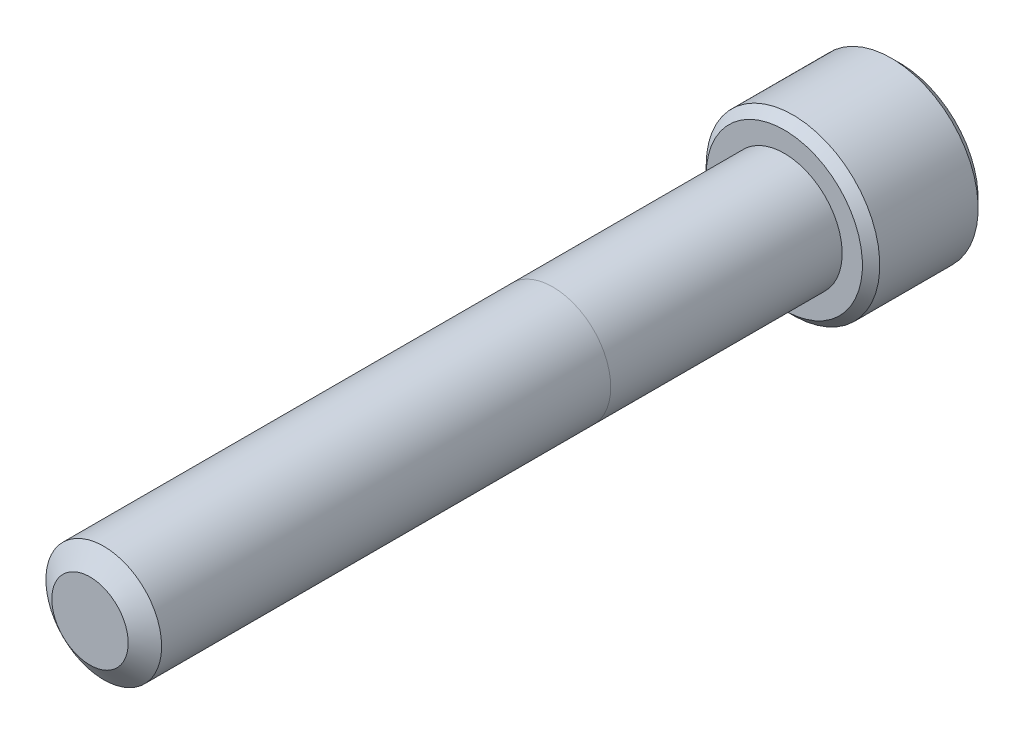
ISO-10303-21;
HEADER;
FILE_DESCRIPTION(('STEP AP214'),'2;1');
FILE_NAME('part.step','',(''),(''),'','','');
FILE_SCHEMA(('AUTOMOTIVE_DESIGN { 1 0 10303 214 1 1 1 1 }'));
ENDSEC;
DATA;
#1=APPLICATION_CONTEXT('core data for automotive mechanical design processes');
#2=APPLICATION_PROTOCOL_DEFINITION('international standard','automotive_design',2000,#1);
#3=PRODUCT_CONTEXT('',#1,'mechanical');
#4=PRODUCT('Part','Part','',(#3));
#5=PRODUCT_RELATED_PRODUCT_CATEGORY('part','',(#4));
#6=PRODUCT_DEFINITION_FORMATION('','',#4);
#7=PRODUCT_DEFINITION_CONTEXT('part definition',#1,'design');
#8=PRODUCT_DEFINITION('design','',#6,#7);
#9=PRODUCT_DEFINITION_SHAPE('','',#8);
#10=(LENGTH_UNIT() NAMED_UNIT(*) SI_UNIT(.MILLI.,.METRE.));
#11=(NAMED_UNIT(*) PLANE_ANGLE_UNIT() SI_UNIT($,.RADIAN.));
#12=(NAMED_UNIT(*) SI_UNIT($,.STERADIAN.) SOLID_ANGLE_UNIT());
#13=UNCERTAINTY_MEASURE_WITH_UNIT(LENGTH_MEASURE(1.E-05),#10,'distance_accuracy_value','');
#14=(GEOMETRIC_REPRESENTATION_CONTEXT(3) GLOBAL_UNCERTAINTY_ASSIGNED_CONTEXT((#13)) GLOBAL_UNIT_ASSIGNED_CONTEXT((#10,
#11,#12)) REPRESENTATION_CONTEXT('',''));
#15=CARTESIAN_POINT('',(0.,0.,0.));
#16=DIRECTION('',(0.,0.,1.));
#17=DIRECTION('',(1.,0.,0.));
#18=AXIS2_PLACEMENT_3D('',#15,#16,#17);
#19=CARTESIAN_POINT('',(0.,0.,-38.1));
#20=DIRECTION('',(0.,0.,1.));
#21=DIRECTION('',(1.,0.,0.));
#22=AXIS2_PLACEMENT_3D('',#19,#20,#21);
#23=CYLINDRICAL_SURFACE('',#22,3.175);
#24=CARTESIAN_POINT('',(0.,0.,-0.755446348705716));
#25=DIRECTION('',(0.,0.,1.));
#26=DIRECTION('',(1.,0.,0.));
#27=AXIS2_PLACEMENT_3D('',#24,#25,#26);
#28=CIRCLE('',#27,3.175);
#29=CARTESIAN_POINT('',(3.175,0.,-0.755446348705716));
#30=VERTEX_POINT('',#29);
#31=EDGE_CURVE('E113',#30,#30,#28,.T.);
#32=ORIENTED_EDGE('',*,*,#31,.F.);
#33=EDGE_LOOP('',(#32));
#34=FACE_BOUND('',#33,.T.);
#35=CARTESIAN_POINT('',(0.,0.,-25.4));
#36=DIRECTION('',(0.,0.,-1.));
#37=DIRECTION('',(-1.,0.,0.));
#38=AXIS2_PLACEMENT_3D('',#35,#36,#37);
#39=CIRCLE('',#38,3.175);
#40=CARTESIAN_POINT('',(3.175,0.,-25.4));
#41=VERTEX_POINT('',#40);
#42=CARTESIAN_POINT('',(-3.175,0.,-25.4));
#43=VERTEX_POINT('',#42);
#44=EDGE_CURVE('E40',#41,#43,#39,.F.);
#45=ORIENTED_EDGE('',*,*,#44,.T.);
#46=EDGE_CURVE('E11',#43,#41,#39,.F.);
#47=ORIENTED_EDGE('',*,*,#46,.T.);
#48=EDGE_LOOP('',(#45,#47));
#49=FACE_BOUND('',#48,.T.);
#50=ADVANCED_FACE('F36',(#34,#49),#23,.T.);
#51=ORIENTED_EDGE('',*,*,#46,.F.);
#52=ORIENTED_EDGE('',*,*,#44,.F.);
#53=EDGE_LOOP('',(#51,#52));
#54=FACE_BOUND('',#53,.T.);
#55=CARTESIAN_POINT('',(0.,0.,-38.1));
#56=DIRECTION('',(0.,0.,-1.));
#57=DIRECTION('',(-1.,0.,0.));
#58=AXIS2_PLACEMENT_3D('',#55,#56,#57);
#59=CIRCLE('',#58,3.175);
#60=CARTESIAN_POINT('',(-3.175,0.,-38.1));
#61=VERTEX_POINT('',#60);
#62=EDGE_CURVE('E197',#61,#61,#59,.F.);
#63=ORIENTED_EDGE('',*,*,#62,.T.);
#64=EDGE_LOOP('',(#63));
#65=FACE_BOUND('',#64,.T.);
#66=ADVANCED_FACE('F190',(#54,#65),#23,.T.);
#67=CARTESIAN_POINT('',(0.,0.,0.));
#68=DIRECTION('',(0.,0.,-1.));
#69=DIRECTION('',(-1.,0.,0.));
#70=AXIS2_PLACEMENT_3D('',#67,#68,#69);
#71=CONICAL_SURFACE('',#70,2.09611080289532,0.959931088596884);
#72=ORIENTED_EDGE('',*,*,#31,.T.);
#73=EDGE_LOOP('',(#72));
#74=FACE_BOUND('',#73,.T.);
#75=CARTESIAN_POINT('',(0.,0.,0.));
#76=DIRECTION('',(0.,0.,1.));
#77=DIRECTION('',(1.,0.,0.));
#78=AXIS2_PLACEMENT_3D('',#75,#76,#77);
#79=CIRCLE('',#78,2.09611080289532);
#80=CARTESIAN_POINT('',(2.09611080289532,0.,0.));
#81=VERTEX_POINT('',#80);
#82=EDGE_CURVE('E199',#81,#81,#79,.T.);
#83=ORIENTED_EDGE('',*,*,#82,.F.);
#84=EDGE_LOOP('',(#83));
#85=FACE_BOUND('',#84,.T.);
#86=ADVANCED_FACE('F193',(#74,#85),#71,.T.);
#87=CARTESIAN_POINT('',(0.,0.,0.));
#88=DIRECTION('',(0.,0.,1.));
#89=DIRECTION('',(1.,0.,0.));
#90=AXIS2_PLACEMENT_3D('',#87,#88,#89);
#91=PLANE('',#90);
#92=ORIENTED_EDGE('',*,*,#82,.T.);
#93=EDGE_LOOP('',(#92));
#94=FACE_BOUND('',#93,.T.);
#95=ADVANCED_FACE('F258',(#94),#91,.T.);
#96=CARTESIAN_POINT('',(0.,0.,-44.45));
#97=DIRECTION('',(0.,0.,1.));
#98=DIRECTION('',(1.,0.,0.));
#99=AXIS2_PLACEMENT_3D('',#96,#97,#98);
#100=CYLINDRICAL_SURFACE('',#99,4.7625);
#101=CARTESIAN_POINT('',(0.,0.,-43.97375));
#102=DIRECTION('',(0.,0.,-1.));
#103=DIRECTION('',(-1.,0.,0.));
#104=AXIS2_PLACEMENT_3D('',#101,#102,#103);
#105=CIRCLE('',#104,4.7625);
#106=CARTESIAN_POINT('',(-4.7625,0.,-43.97375));
#107=VERTEX_POINT('',#106);
#108=EDGE_CURVE('E181',#107,#107,#105,.F.);
#109=ORIENTED_EDGE('',*,*,#108,.T.);
#110=EDGE_LOOP('',(#109));
#111=FACE_BOUND('',#110,.T.);
#112=CARTESIAN_POINT('',(0.,0.,-38.57625));
#113=DIRECTION('',(0.,0.,-1.));
#114=DIRECTION('',(-1.,0.,0.));
#115=AXIS2_PLACEMENT_3D('',#112,#113,#114);
#116=CIRCLE('',#115,4.7625);
#117=CARTESIAN_POINT('',(-4.7625,0.,-38.57625));
#118=VERTEX_POINT('',#117);
#119=EDGE_CURVE('E178',#118,#118,#116,.T.);
#120=ORIENTED_EDGE('',*,*,#119,.T.);
#121=EDGE_LOOP('',(#120));
#122=FACE_BOUND('',#121,.T.);
#123=ADVANCED_FACE('F274',(#111,#122),#100,.T.);
#124=CARTESIAN_POINT('',(0.,0.,-44.45));
#125=DIRECTION('',(0.,0.,-1.));
#126=DIRECTION('',(-1.,0.,0.));
#127=AXIS2_PLACEMENT_3D('',#124,#125,#126);
#128=PLANE('',#127);
#129=CARTESIAN_POINT('',(0.,0.,-44.45));
#130=DIRECTION('',(0.,0.,-1.));
#131=DIRECTION('',(-1.,0.,0.));
#132=AXIS2_PLACEMENT_3D('',#129,#130,#131);
#133=CIRCLE('',#132,4.28625000000001);
#134=CARTESIAN_POINT('',(-4.28625000000001,0.,-44.45));
#135=VERTEX_POINT('',#134);
#136=EDGE_CURVE('E112',#135,#135,#133,.T.);
#137=ORIENTED_EDGE('',*,*,#136,.T.);
#138=EDGE_LOOP('',(#137));
#139=FACE_BOUND('',#138,.T.);
#140=CARTESIAN_POINT('',(0.,0.,-44.45));
#141=DIRECTION('',(0.,0.,-1.));
#142=DIRECTION('',(-1.,0.,0.));
#143=AXIS2_PLACEMENT_3D('',#140,#141,#142);
#144=CIRCLE('',#143,2.74963065701559);
#145=CARTESIAN_POINT('',(-2.38125,1.3748153285078,-44.45));
#146=VERTEX_POINT('',#145);
#147=CARTESIAN_POINT('',(0.,2.74963065701559,-44.45));
#148=VERTEX_POINT('',#147);
#149=EDGE_CURVE('E91',#146,#148,#144,.T.);
#150=ORIENTED_EDGE('',*,*,#149,.F.);
#151=CARTESIAN_POINT('',(-2.38125,-1.3748153285078,-44.45));
#152=VERTEX_POINT('',#151);
#153=EDGE_CURVE('E103',#152,#146,#144,.T.);
#154=ORIENTED_EDGE('',*,*,#153,.F.);
#155=CARTESIAN_POINT('',(0.,-2.74963065701559,-44.45));
#156=VERTEX_POINT('',#155);
#157=EDGE_CURVE('E437',#156,#152,#144,.T.);
#158=ORIENTED_EDGE('',*,*,#157,.F.);
#159=CARTESIAN_POINT('',(2.38125,-1.3748153285078,-44.45));
#160=VERTEX_POINT('',#159);
#161=EDGE_CURVE('E136',#160,#156,#144,.T.);
#162=ORIENTED_EDGE('',*,*,#161,.F.);
#163=CARTESIAN_POINT('',(2.38125,1.3748153285078,-44.45));
#164=VERTEX_POINT('',#163);
#165=EDGE_CURVE('E135',#164,#160,#144,.T.);
#166=ORIENTED_EDGE('',*,*,#165,.F.);
#167=EDGE_CURVE('E101',#148,#164,#144,.T.);
#168=ORIENTED_EDGE('',*,*,#167,.F.);
#169=EDGE_LOOP('',(#150,#154,#158,#162,#166,#168));
#170=FACE_BOUND('',#169,.T.);
#171=ADVANCED_FACE('F133',(#139,#170),#128,.T.);
#172=CARTESIAN_POINT('',(0.,0.,-38.1));
#173=DIRECTION('',(0.,0.,-1.));
#174=DIRECTION('',(-1.,0.,0.));
#175=AXIS2_PLACEMENT_3D('',#172,#173,#174);
#176=PLANE('',#175);
#177=CARTESIAN_POINT('',(0.,0.,-38.1));
#178=DIRECTION('',(0.,0.,-1.));
#179=DIRECTION('',(-1.,0.,0.));
#180=AXIS2_PLACEMENT_3D('',#177,#178,#179);
#181=CIRCLE('',#180,4.28624999999999);
#182=CARTESIAN_POINT('',(-4.28624999999999,0.,-38.1));
#183=VERTEX_POINT('',#182);
#184=EDGE_CURVE('E183',#183,#183,#181,.F.);
#185=ORIENTED_EDGE('',*,*,#184,.T.);
#186=EDGE_LOOP('',(#185));
#187=FACE_BOUND('',#186,.T.);
#188=ORIENTED_EDGE('',*,*,#62,.F.);
#189=EDGE_LOOP('',(#188));
#190=FACE_BOUND('',#189,.T.);
#191=ADVANCED_FACE('F273',(#187,#190),#176,.F.);
#192=CARTESIAN_POINT('',(0.,0.,-44.45));
#193=DIRECTION('',(0.,0.,-1.));
#194=DIRECTION('',(-1.,0.,0.));
#195=AXIS2_PLACEMENT_3D('',#192,#193,#194);
#196=CONICAL_SURFACE('',#195,2.74963065701559,0.78539816339745);
#197=ORIENTED_EDGE('',*,*,#167,.T.);
#198=CARTESIAN_POINT('',(-0.000199999999999015,2.74974612706943,-44.4501154773272));
#199=CARTESIAN_POINT('',(0.0816567823790507,2.70248609172789,-44.4028948967095));
#200=CARTESIAN_POINT('',(0.164882333771761,2.65443579722785,-44.3584475752929));
#201=CARTESIAN_POINT('',(0.334588480838041,2.556455907536,-44.2770654569856));
#202=CARTESIAN_POINT('',(0.421085217353104,2.50651699342501,-44.2401759430951));
#203=CARTESIAN_POINT('',(0.595501774009044,2.40581754748857,-44.1769834131659));
#204=CARTESIAN_POINT('',(0.683377171180677,2.35508266327638,-44.1505215587295));
#205=CARTESIAN_POINT('',(0.861062594070877,2.25249593653965,-44.1097515156161));
#206=CARTESIAN_POINT('',(0.950867191185873,2.20064722822085,-44.0954128915306));
#207=CARTESIAN_POINT('',(1.10563960313034,2.11128933452158,-44.0824757847701));
#208=CARTESIAN_POINT('',(1.17040744896962,2.07389560129144,-44.0805606046532));
#209=CARTESIAN_POINT('',(1.29983727933558,1.99916925388849,-44.0837866227677));
#210=CARTESIAN_POINT('',(1.36449921879336,1.96183666573621,-44.0889302948571));
#211=CARTESIAN_POINT('',(1.4932125485774,1.8875239901371,-44.1059813108716));
#212=CARTESIAN_POINT('',(1.55726317423486,1.85054434417201,-44.1178962213493));
#213=CARTESIAN_POINT('',(1.68425683890528,1.77722451768916,-44.147835672352));
#214=CARTESIAN_POINT('',(1.74719996243583,1.74088428837516,-44.1658597445185));
#215=CARTESIAN_POINT('',(1.90842615073218,1.64780030516185,-44.2193688075524));
#216=CARTESIAN_POINT('',(2.00570949128784,1.59163374230437,-44.2588874208722));
#217=CARTESIAN_POINT('',(2.14875606262557,1.50904576583588,-44.3256003435508));
#218=CARTESIAN_POINT('',(2.19589628894397,1.48182934348129,-44.3490402091113));
#219=CARTESIAN_POINT('',(2.28930352636664,1.42790064981105,-44.3980566766595));
#220=CARTESIAN_POINT('',(2.33557105249682,1.40118808114506,-44.4236319667669));
#221=CARTESIAN_POINT('',(2.38145,1.37469985845396,-44.4501154773272));
#222=B_SPLINE_CURVE_WITH_KNOTS('',3,(#198,#199,#200,#201,#202,#203,#204,#205,#206,#207,#208,
#209,#210,#211,#212,#213,#214,#215,#216,#217,#218,#219,#220,#221),.UNSPECIFIED.,.F.,.F.,(4,2,2,
2,2,2,2,2,2,2,2,4),(0.,0.317196610611949,0.636241461041219,0.950218950629223,1.26340583824126,
1.48752413747844,1.71172100167747,1.93616888974082,2.16059957440836,2.51709639744762,
2.69486147369099,2.87251813383153),.UNSPECIFIED.);
#223=EDGE_CURVE('E107',#148,#164,#222,.T.);
#224=ORIENTED_EDGE('',*,*,#223,.F.);
#225=EDGE_LOOP('',(#197,#224));
#226=FACE_BOUND('',#225,.T.);
#227=ADVANCED_FACE('F108',(#226),#196,.F.);
#228=ORIENTED_EDGE('',*,*,#165,.T.);
#229=CARTESIAN_POINT('',(2.38125,-2.7419429062928,-45.3319808948811));
#230=CARTESIAN_POINT('',(2.38125,-2.67517961094814,-45.2815846682677));
#231=CARTESIAN_POINT('',(2.38125,-2.60804251150403,-45.2316755878687));
#232=CARTESIAN_POINT('',(2.38125,-2.47287325090701,-45.1330498312406));
#233=CARTESIAN_POINT('',(2.38125,-2.40484086929573,-45.0843334574882));
#234=CARTESIAN_POINT('',(2.38125,-2.26723593537395,-44.9879648546737));
#235=CARTESIAN_POINT('',(2.38125,-2.1976555337683,-44.9403237956413));
#236=CARTESIAN_POINT('',(2.38125,-2.05731367870618,-44.8468199235723));
#237=CARTESIAN_POINT('',(2.38125,-1.98655230919794,-44.800956984903));
#238=CARTESIAN_POINT('',(2.38125,-1.83957751933871,-44.7088459008639));
#239=CARTESIAN_POINT('',(2.38125,-1.76328362015337,-44.6627255175311));
#240=CARTESIAN_POINT('',(2.38125,-1.60891357724904,-44.5735183040048));
#241=CARTESIAN_POINT('',(2.38125,-1.53083712168147,-44.530432010078));
#242=CARTESIAN_POINT('',(2.38125,-1.37291620350605,-44.4482265015513));
#243=CARTESIAN_POINT('',(2.38125,-1.29307799952833,-44.4090953579213));
#244=CARTESIAN_POINT('',(2.38125,-1.13121425104688,-44.3356679503644));
#245=CARTESIAN_POINT('',(2.38125,-1.04918943691787,-44.3013700954936));
#246=CARTESIAN_POINT('',(2.38125,-0.889535256852423,-44.2413546314485));
#247=CARTESIAN_POINT('',(2.38125,-0.812083865872983,-44.2151684784655));
#248=CARTESIAN_POINT('',(2.38125,-0.655316366649842,-44.1690097515196));
#249=CARTESIAN_POINT('',(2.38125,-0.576000130348893,-44.1490376056152));
#250=CARTESIAN_POINT('',(2.38125,-0.417295761724879,-44.1166821452753));
#251=CARTESIAN_POINT('',(2.38125,-0.337934577044905,-44.1041688083777));
#252=CARTESIAN_POINT('',(2.38125,-0.178363853149427,-44.0869738601797));
#253=CARTESIAN_POINT('',(2.38125,-0.098154462150844,-44.0822909026207));
#254=CARTESIAN_POINT('',(2.38125,0.0594188032260163,-44.0811044408343));
#255=CARTESIAN_POINT('',(2.38125,0.136780588312053,-44.0843110104925));
#256=CARTESIAN_POINT('',(2.38125,0.290840960378529,-44.0980870567153));
#257=CARTESIAN_POINT('',(2.38125,0.367539482199556,-44.1086572485512));
#258=CARTESIAN_POINT('',(2.38125,0.521017492585631,-44.1367628297993));
#259=CARTESIAN_POINT('',(2.38125,0.597774958137452,-44.1544167488691));
#260=CARTESIAN_POINT('',(2.38125,0.749609813987393,-44.1957513961625));
#261=CARTESIAN_POINT('',(2.38125,0.82468734429223,-44.2194316201001));
#262=CARTESIAN_POINT('',(2.38125,1.0610781437644,-44.3028948628217));
#263=CARTESIAN_POINT('',(2.38125,1.21904786183135,-44.3721839268647));
#264=CARTESIAN_POINT('',(2.38125,1.45021000221342,-44.4876640836208));
#265=CARTESIAN_POINT('',(2.38125,1.52644290394186,-44.5281730569973));
#266=CARTESIAN_POINT('',(2.38125,1.67717618485052,-44.6123026889314));
#267=CARTESIAN_POINT('',(2.38125,1.75167687303398,-44.6559227867715));
#268=CARTESIAN_POINT('',(2.38125,1.89548152028666,-44.7434125561176));
#269=CARTESIAN_POINT('',(2.38125,1.96485959547431,-44.78716179235));
#270=CARTESIAN_POINT('',(2.38125,2.10242624345817,-44.8765011582982));
#271=CARTESIAN_POINT('',(2.38125,2.17061472559402,-44.9220914274512));
#272=CARTESIAN_POINT('',(2.38125,2.30540317246411,-45.0144060045998));
#273=CARTESIAN_POINT('',(2.38125,2.3720115414939,-45.0611180923826));
#274=CARTESIAN_POINT('',(2.38125,2.50431799978027,-45.1557775774644));
#275=CARTESIAN_POINT('',(2.38125,2.57001633432538,-45.2037246315223));
#276=CARTESIAN_POINT('',(2.38125,2.63533378775874,-45.2521767329484));
#277=B_SPLINE_CURVE_WITH_KNOTS('',3,(#229,#230,#231,#232,#233,#234,#235,#236,#237,#238,#239,
#240,#241,#242,#243,#244,#245,#246,#247,#248,#249,#250,#251,#252,#253,#254,#255,#256,#257,#258,
#259,#260,#261,#262,#263,#264,#265,#266,#267,#268,#269,#270,#271,#272,#273,#274,#275,#276),
.UNSPECIFIED.,.F.,.F.,(4,2,2,2,2,2,2,2,2,2,2,2,2,2,2,2,2,2,2,2,2,2,2,4),(0.,0.250951284057754,
0.501965564923431,0.754924776117812,1.00786608183831,1.27526207823639,1.54270521810291,
1.80931602064962,2.07583885853549,2.32089852628726,2.56597507150035,2.80664400340548,
3.04727155341464,3.27918940999225,3.51112979724108,3.74712477430216,3.98310000960232,
4.49898139186046,4.75794323923241,5.01685853131884,5.26288959989712,5.50893933760936,
5.75299038355429,5.99697431578282),.UNSPECIFIED.);
#278=EDGE_CURVE('E100',#164,#160,#277,.F.);
#279=ORIENTED_EDGE('',*,*,#278,.F.);
#280=EDGE_LOOP('',(#228,#279));
#281=FACE_BOUND('',#280,.T.);
#282=ADVANCED_FACE('F374',(#281),#196,.F.);
#283=ORIENTED_EDGE('',*,*,#161,.T.);
#284=CARTESIAN_POINT('',(2.38145,-1.37469985845396,-44.4501154773272));
#285=CARTESIAN_POINT('',(2.29959321762095,-1.4219598937955,-44.4028948967095));
#286=CARTESIAN_POINT('',(2.21636766622824,-1.47001018829554,-44.3584475752929));
#287=CARTESIAN_POINT('',(2.04666151916196,-1.56799007798739,-44.2770654569856));
#288=CARTESIAN_POINT('',(1.96016478264689,-1.61792899209838,-44.2401759430951));
#289=CARTESIAN_POINT('',(1.78574822599096,-1.71862843803482,-44.1769834131659));
#290=CARTESIAN_POINT('',(1.69787282881932,-1.76936332224701,-44.1505215587295));
#291=CARTESIAN_POINT('',(1.52018740592912,-1.87195004898374,-44.1097515156161));
#292=CARTESIAN_POINT('',(1.43038280881413,-1.92379875730254,-44.0954128915306));
#293=CARTESIAN_POINT('',(1.27561039686966,-2.01315665100181,-44.0824757847701));
#294=CARTESIAN_POINT('',(1.21084255103038,-2.05055038423195,-44.0805606046532));
#295=CARTESIAN_POINT('',(1.08141272066442,-2.1252767316349,-44.0837866227677));
#296=CARTESIAN_POINT('',(1.01675078120664,-2.16260931978718,-44.0889302948571));
#297=CARTESIAN_POINT('',(0.8880374514226,-2.23692199538629,-44.1059813108716));
#298=CARTESIAN_POINT('',(0.823986825765142,-2.27390164135138,-44.1178962213493));
#299=CARTESIAN_POINT('',(0.696993161094723,-2.34722146783423,-44.147835672352));
#300=CARTESIAN_POINT('',(0.634050037564173,-2.38356169714823,-44.1658597445185));
#301=CARTESIAN_POINT('',(0.472823849267816,-2.47664568036154,-44.2193688075524));
#302=CARTESIAN_POINT('',(0.375540508712157,-2.53281224321902,-44.2588874208722));
#303=CARTESIAN_POINT('',(0.232493937374428,-2.61540021968751,-44.3256003435508));
#304=CARTESIAN_POINT('',(0.185353711056034,-2.64261664204209,-44.3490402091113));
#305=CARTESIAN_POINT('',(0.0919464736333625,-2.69654533571233,-44.3980566766595));
#306=CARTESIAN_POINT('',(0.0456789475031799,-2.72325790437833,-44.4236319667669));
#307=CARTESIAN_POINT('',(-0.000199999999998765,-2.74974612706943,-44.4501154773272));
#308=B_SPLINE_CURVE_WITH_KNOTS('',3,(#284,#285,#286,#287,#288,#289,#290,#291,#292,#293,#294,
#295,#296,#297,#298,#299,#300,#301,#302,#303,#304,#305,#306,#307),.UNSPECIFIED.,.F.,.F.,(4,2,2,
2,2,2,2,2,2,2,2,4),(0.,0.317196610611951,0.63624146104122,0.950218950629225,1.26340583824126,
1.48752413747844,1.71172100167747,1.93616888974082,2.16059957440836,2.51709639744763,
2.69486147369099,2.87251813383154),.UNSPECIFIED.);
#309=EDGE_CURVE('E146',#160,#156,#308,.T.);
#310=ORIENTED_EDGE('',*,*,#309,.F.);
#311=EDGE_LOOP('',(#283,#310));
#312=FACE_BOUND('',#311,.T.);
#313=ADVANCED_FACE('F366',(#312),#196,.F.);
#314=ORIENTED_EDGE('',*,*,#157,.T.);
#315=CARTESIAN_POINT('',(0.000200000000000177,-2.74974612706943,-44.4501154773272));
#316=CARTESIAN_POINT('',(-0.0816567823790503,-2.70248609172789,-44.4028948967095));
#317=CARTESIAN_POINT('',(-0.164882333771761,-2.65443579722785,-44.3584475752929));
#318=CARTESIAN_POINT('',(-0.334588480838042,-2.556455907536,-44.2770654569856));
#319=CARTESIAN_POINT('',(-0.421085217353105,-2.50651699342501,-44.2401759430951));
#320=CARTESIAN_POINT('',(-0.595501774009045,-2.40581754748857,-44.1769834131659));
#321=CARTESIAN_POINT('',(-0.683377171180677,-2.35508266327638,-44.1505215587295));
#322=CARTESIAN_POINT('',(-0.861062594070878,-2.25249593653965,-44.1097515156161));
#323=CARTESIAN_POINT('',(-0.950867191185874,-2.20064722822084,-44.0954128915306));
#324=CARTESIAN_POINT('',(-1.10563960313034,-2.11128933452158,-44.0824757847701));
#325=CARTESIAN_POINT('',(-1.17040744896962,-2.07389560129144,-44.0805606046532));
#326=CARTESIAN_POINT('',(-1.29983727933558,-1.99916925388849,-44.0837866227677));
#327=CARTESIAN_POINT('',(-1.36449921879336,-1.96183666573621,-44.0889302948571));
#328=CARTESIAN_POINT('',(-1.4932125485774,-1.8875239901371,-44.1059813108716));
#329=CARTESIAN_POINT('',(-1.55726317423486,-1.85054434417201,-44.1178962213493));
#330=CARTESIAN_POINT('',(-1.68425683890528,-1.77722451768916,-44.147835672352));
#331=CARTESIAN_POINT('',(-1.74719996243583,-1.74088428837516,-44.1658597445185));
#332=CARTESIAN_POINT('',(-1.90842615073218,-1.64780030516184,-44.2193688075524));
#333=CARTESIAN_POINT('',(-2.00570949128784,-1.59163374230437,-44.2588874208722));
#334=CARTESIAN_POINT('',(-2.14875606262557,-1.50904576583588,-44.3256003435508));
#335=CARTESIAN_POINT('',(-2.19589628894397,-1.48182934348129,-44.3490402091113));
#336=CARTESIAN_POINT('',(-2.28930352636664,-1.42790064981105,-44.3980566766595));
#337=CARTESIAN_POINT('',(-2.33557105249682,-1.40118808114505,-44.4236319667669));
#338=CARTESIAN_POINT('',(-2.38145,-1.37469985845396,-44.4501154773272));
#339=B_SPLINE_CURVE_WITH_KNOTS('',3,(#315,#316,#317,#318,#319,#320,#321,#322,#323,#324,#325,
#326,#327,#328,#329,#330,#331,#332,#333,#334,#335,#336,#337,#338),.UNSPECIFIED.,.F.,.F.,(4,2,2,
2,2,2,2,2,2,2,2,4),(0.,0.317196610611951,0.63624146104122,0.950218950629225,1.26340583824126,
1.48752413747844,1.71172100167747,1.93616888974082,2.16059957440836,2.51709639744763,
2.69486147369099,2.87251813383154),.UNSPECIFIED.);
#340=EDGE_CURVE('E235',#156,#152,#339,.T.);
#341=ORIENTED_EDGE('',*,*,#340,.F.);
#342=EDGE_LOOP('',(#314,#341));
#343=FACE_BOUND('',#342,.T.);
#344=ADVANCED_FACE('F358',(#343),#196,.F.);
#345=ORIENTED_EDGE('',*,*,#153,.T.);
#346=CARTESIAN_POINT('',(-2.38125,-2.74194290589387,-45.3319808945799));
#347=CARTESIAN_POINT('',(-2.38125,-2.67517961056039,-45.2815846679781));
#348=CARTESIAN_POINT('',(-2.38125,-2.60804251112752,-45.2316755875907));
#349=CARTESIAN_POINT('',(-2.38125,-2.47287325055307,-45.1330498309857));
#350=CARTESIAN_POINT('',(-2.38125,-2.40484086895312,-45.0843334572448));
#351=CARTESIAN_POINT('',(-2.38125,-2.2672359350544,-44.9879648544534));
#352=CARTESIAN_POINT('',(-2.38125,-2.19765553346049,-44.9403237954326));
#353=CARTESIAN_POINT('',(-2.38125,-2.05731367842203,-44.8468199233866));
#354=CARTESIAN_POINT('',(-2.38125,-1.98655230892573,-44.8009569847287));
#355=CARTESIAN_POINT('',(-2.38125,-1.83957751909225,-44.7088459007133));
#356=CARTESIAN_POINT('',(-2.38125,-1.76328361992075,-44.6627255173928));
#357=CARTESIAN_POINT('',(-2.38125,-1.60891357704459,-44.5735183038905));
#358=CARTESIAN_POINT('',(-2.38125,-1.53083712149137,-44.5304320099754));
#359=CARTESIAN_POINT('',(-2.38125,-1.37291620334514,-44.4482265014712));
#360=CARTESIAN_POINT('',(-2.38125,-1.29307799938228,-44.4090953578519));
#361=CARTESIAN_POINT('',(-2.38125,-1.13121425093132,-44.3356679503152));
#362=CARTESIAN_POINT('',(-2.38125,-1.04918943681795,-44.3013700954538));
#363=CARTESIAN_POINT('',(-2.38125,-0.88953525675927,-44.2413546314156));
#364=CARTESIAN_POINT('',(-2.38125,-0.812083865770258,-44.215168478432));
#365=CARTESIAN_POINT('',(-2.38125,-0.655316366527662,-44.1690097514868));
#366=CARTESIAN_POINT('',(-2.38125,-0.57600013021683,-44.1490376055837));
#367=CARTESIAN_POINT('',(-2.38125,-0.417295761573375,-44.1166821452488));
#368=CARTESIAN_POINT('',(-2.38125,-0.337934576883847,-44.1041688083547));
#369=CARTESIAN_POINT('',(-2.38125,-0.178363852969583,-44.0869738601659));
#370=CARTESIAN_POINT('',(-2.38125,-0.0981544619617666,-44.0822909026126));
#371=CARTESIAN_POINT('',(-2.38125,0.0594188034321297,-44.0811044408392));
#372=CARTESIAN_POINT('',(-2.38125,0.136780588525993,-44.0843110105046));
#373=CARTESIAN_POINT('',(-2.38125,0.290840960607339,-44.0980870567428));
#374=CARTESIAN_POINT('',(-2.38125,0.367539482435409,-44.1086572485871));
#375=CARTESIAN_POINT('',(-2.38125,0.521017492835388,-44.1367628298525));
#376=CARTESIAN_POINT('',(-2.38125,0.597774958394048,-44.1544167489315));
#377=CARTESIAN_POINT('',(-2.38125,0.749609814257009,-44.1957513962434));
#378=CARTESIAN_POINT('',(-2.38125,0.824687344568026,-44.2194316201904));
#379=CARTESIAN_POINT('',(-2.38125,1.06107814410025,-44.302894862956));
#380=CARTESIAN_POINT('',(-2.38125,1.2190478622181,-44.3721839270396));
#381=CARTESIAN_POINT('',(-2.38125,1.45021000267341,-44.4876640838597));
#382=CARTESIAN_POINT('',(-2.38125,1.52644290442584,-44.5281730572583));
#383=CARTESIAN_POINT('',(-2.38125,1.67717618538172,-44.6123026892371));
#384=CARTESIAN_POINT('',(-2.38125,1.7516768735884,-44.6559227870999));
#385=CARTESIAN_POINT('',(-2.38125,1.89548152088327,-44.743412556489));
#386=CARTESIAN_POINT('',(-2.38125,1.96485959608998,-44.7871617927418));
#387=CARTESIAN_POINT('',(-2.38125,2.10242624411168,-44.8765011587306));
#388=CARTESIAN_POINT('',(-2.38125,2.17061472626633,-44.922091427904));
#389=CARTESIAN_POINT('',(-2.38125,2.30540317317354,-45.0144060050932));
#390=CARTESIAN_POINT('',(-2.38125,2.37201154222166,-45.0611180928962));
#391=CARTESIAN_POINT('',(-2.38125,2.50431800054459,-45.1557775780183));
#392=CARTESIAN_POINT('',(-2.38125,2.57001633510792,-45.2037246320963));
#393=CARTESIAN_POINT('',(-2.38125,2.63533378855947,-45.2521767335425));
#394=B_SPLINE_CURVE_WITH_KNOTS('',3,(#346,#347,#348,#349,#350,#351,#352,#353,#354,#355,#356,
#357,#358,#359,#360,#361,#362,#363,#364,#365,#366,#367,#368,#369,#370,#371,#372,#373,#374,#375,
#376,#377,#378,#379,#380,#381,#382,#383,#384,#385,#386,#387,#388,#389,#390,#391,#392,#393),
.UNSPECIFIED.,.F.,.F.,(4,2,2,2,2,2,2,2,2,2,2,2,2,2,2,2,2,2,2,2,2,2,2,4),(0.,0.250951284009988,
0.50196556482789,0.754924775973593,1.00786608164542,1.27526207798892,1.54270521780083,
1.80931602029339,2.07583885812519,2.32089852590464,2.56597507114536,2.80664400307698,
3.04727155311265,3.27918940971451,3.51112979698762,3.74712477407482,3.98310000940112,
4.49898139184704,4.75794323931354,5.01685853149448,5.2628896001536,5.50893933794672,
5.75299038397142,5.9969743162797),.UNSPECIFIED.);
#395=EDGE_CURVE('E123',#152,#146,#394,.T.);
#396=ORIENTED_EDGE('',*,*,#395,.F.);
#397=EDGE_LOOP('',(#345,#396));
#398=FACE_BOUND('',#397,.T.);
#399=ADVANCED_FACE('F350',(#398),#196,.F.);
#400=ORIENTED_EDGE('',*,*,#149,.T.);
#401=CARTESIAN_POINT('',(-2.38145,1.37469985845396,-44.4501154773272));
#402=CARTESIAN_POINT('',(-2.29959321762095,1.4219598937955,-44.4028948967095));
#403=CARTESIAN_POINT('',(-2.21636766622824,1.47001018829554,-44.3584475752929));
#404=CARTESIAN_POINT('',(-2.04666151916196,1.56799007798739,-44.2770654569856));
#405=CARTESIAN_POINT('',(-1.9601647826469,1.61792899209838,-44.2401759430951));
#406=CARTESIAN_POINT('',(-1.78574822599095,1.71862843803482,-44.1769834131659));
#407=CARTESIAN_POINT('',(-1.69787282881932,1.76936332224701,-44.1505215587295));
#408=CARTESIAN_POINT('',(-1.52018740592912,1.87195004898374,-44.1097515156161));
#409=CARTESIAN_POINT('',(-1.43038280881413,1.92379875730254,-44.0954128915306));
#410=CARTESIAN_POINT('',(-1.27561039686966,2.01315665100181,-44.0824757847701));
#411=CARTESIAN_POINT('',(-1.21084255103038,2.05055038423195,-44.0805606046532));
#412=CARTESIAN_POINT('',(-1.08141272066442,2.1252767316349,-44.0837866227677));
#413=CARTESIAN_POINT('',(-1.01675078120664,2.16260931978718,-44.0889302948571));
#414=CARTESIAN_POINT('',(-0.8880374514226,2.23692199538629,-44.1059813108716));
#415=CARTESIAN_POINT('',(-0.823986825765143,2.27390164135138,-44.1178962213493));
#416=CARTESIAN_POINT('',(-0.696993161094723,2.34722146783423,-44.147835672352));
#417=CARTESIAN_POINT('',(-0.634050037564173,2.38356169714822,-44.1658597445185));
#418=CARTESIAN_POINT('',(-0.472823849267817,2.47664568036154,-44.2193688075524));
#419=CARTESIAN_POINT('',(-0.375540508712159,2.53281224321902,-44.2588874208722));
#420=CARTESIAN_POINT('',(-0.232493937374431,2.61540021968751,-44.3256003435508));
#421=CARTESIAN_POINT('',(-0.185353711056036,2.64261664204209,-44.3490402091113));
#422=CARTESIAN_POINT('',(-0.0919464736333628,2.69654533571233,-44.3980566766595));
#423=CARTESIAN_POINT('',(-0.0456789475031795,2.72325790437833,-44.4236319667669));
#424=CARTESIAN_POINT('',(0.000199999999999924,2.74974612706943,-44.4501154773272));
#425=B_SPLINE_CURVE_WITH_KNOTS('',3,(#401,#402,#403,#404,#405,#406,#407,#408,#409,#410,#411,
#412,#413,#414,#415,#416,#417,#418,#419,#420,#421,#422,#423,#424),.UNSPECIFIED.,.F.,.F.,(4,2,2,
2,2,2,2,2,2,2,2,4),(0.,0.317196610611949,0.63624146104122,0.950218950629225,1.26340583824126,
1.48752413747844,1.71172100167747,1.93616888974082,2.16059957440836,2.51709639744763,
2.69486147369099,2.87251813383154),.UNSPECIFIED.);
#426=EDGE_CURVE('E95',#146,#148,#425,.T.);
#427=ORIENTED_EDGE('',*,*,#426,.F.);
#428=EDGE_LOOP('',(#400,#427));
#429=FACE_BOUND('',#428,.T.);
#430=ADVANCED_FACE('F93',(#429),#196,.F.);
#431=CARTESIAN_POINT('',(2.38125,4.12444598552339,-40.878125));
#432=DIRECTION('',(0.,0.,-1.));
#433=DIRECTION('',(-1.,0.,0.));
#434=AXIS2_PLACEMENT_3D('',#431,#432,#433);
#435=PLANE('',#434);
#436=DIRECTION('',(0.866025403784439,0.5,0.));
#437=VECTOR('',#436,1.);
#438=CARTESIAN_POINT('',(-2.38125,1.3748153285078,-40.878125));
#439=LINE('',#438,#437);
#440=CARTESIAN_POINT('',(-2.38125,1.3748153285078,-40.878125));
#441=VERTEX_POINT('',#440);
#442=CARTESIAN_POINT('',(0.,2.74963065701559,-40.878125));
#443=VERTEX_POINT('',#442);
#444=EDGE_CURVE('E122',#441,#443,#439,.T.);
#445=ORIENTED_EDGE('',*,*,#444,.T.);
#446=DIRECTION('',(0.866025403784439,-0.5,0.));
#447=VECTOR('',#446,1.);
#448=CARTESIAN_POINT('',(0.,2.74963065701559,-40.878125));
#449=LINE('',#448,#447);
#450=CARTESIAN_POINT('',(2.38125,1.3748153285078,-40.878125));
#451=VERTEX_POINT('',#450);
#452=EDGE_CURVE('E127',#443,#451,#449,.T.);
#453=ORIENTED_EDGE('',*,*,#452,.T.);
#454=DIRECTION('',(0.,-1.,0.));
#455=VECTOR('',#454,1.);
#456=CARTESIAN_POINT('',(2.38125,1.3748153285078,-40.878125));
#457=LINE('',#456,#455);
#458=CARTESIAN_POINT('',(2.38125,-1.3748153285078,-40.878125));
#459=VERTEX_POINT('',#458);
#460=EDGE_CURVE('E221',#451,#459,#457,.T.);
#461=ORIENTED_EDGE('',*,*,#460,.T.);
#462=DIRECTION('',(-0.866025403784439,-0.5,0.));
#463=VECTOR('',#462,1.);
#464=CARTESIAN_POINT('',(2.38125,-1.3748153285078,-40.878125));
#465=LINE('',#464,#463);
#466=CARTESIAN_POINT('',(0.,-2.74963065701559,-40.878125));
#467=VERTEX_POINT('',#466);
#468=EDGE_CURVE('E218',#459,#467,#465,.T.);
#469=ORIENTED_EDGE('',*,*,#468,.T.);
#470=DIRECTION('',(-0.866025403784439,0.5,0.));
#471=VECTOR('',#470,1.);
#472=CARTESIAN_POINT('',(0.,-2.74963065701559,-40.878125));
#473=LINE('',#472,#471);
#474=CARTESIAN_POINT('',(-2.38125,-1.3748153285078,-40.878125));
#475=VERTEX_POINT('',#474);
#476=EDGE_CURVE('E215',#467,#475,#473,.T.);
#477=ORIENTED_EDGE('',*,*,#476,.T.);
#478=DIRECTION('',(0.,1.,0.));
#479=VECTOR('',#478,1.);
#480=CARTESIAN_POINT('',(-2.38125,-1.3748153285078,-40.878125));
#481=LINE('',#480,#479);
#482=EDGE_CURVE('E130',#475,#441,#481,.T.);
#483=ORIENTED_EDGE('',*,*,#482,.T.);
#484=EDGE_LOOP('',(#445,#453,#461,#469,#477,#483));
#485=FACE_BOUND('',#484,.T.);
#486=ADVANCED_FACE('F166',(#485),#435,.T.);
#487=CARTESIAN_POINT('',(0.,2.74963065701559,-40.878125));
#488=DIRECTION('',(0.5,0.866025403784439,0.));
#489=DIRECTION('',(-0.866025403784439,0.5,0.));
#490=AXIS2_PLACEMENT_3D('',#487,#488,#489);
#491=PLANE('',#490);
#492=DIRECTION('',(0.,0.,-1.));
#493=VECTOR('',#492,1.);
#494=CARTESIAN_POINT('',(0.,2.74963065701559,-40.878125));
#495=LINE('',#494,#493);
#496=EDGE_CURVE('E119',#443,#148,#495,.T.);
#497=ORIENTED_EDGE('',*,*,#496,.T.);
#498=ORIENTED_EDGE('',*,*,#223,.T.);
#499=DIRECTION('',(0.,0.,-1.));
#500=VECTOR('',#499,1.);
#501=CARTESIAN_POINT('',(2.38125,1.3748153285078,-40.878125));
#502=LINE('',#501,#500);
#503=EDGE_CURVE('E129',#451,#164,#502,.T.);
#504=ORIENTED_EDGE('',*,*,#503,.F.);
#505=ORIENTED_EDGE('',*,*,#452,.F.);
#506=EDGE_LOOP('',(#497,#498,#504,#505));
#507=FACE_BOUND('',#506,.T.);
#508=ADVANCED_FACE('F125',(#507),#491,.F.);
#509=CARTESIAN_POINT('',(2.38125,1.3748153285078,-40.878125));
#510=DIRECTION('',(1.,0.,0.));
#511=DIRECTION('',(0.,1.,0.));
#512=AXIS2_PLACEMENT_3D('',#509,#510,#511);
#513=PLANE('',#512);
#514=ORIENTED_EDGE('',*,*,#503,.T.);
#515=ORIENTED_EDGE('',*,*,#278,.T.);
#516=DIRECTION('',(0.,0.,-1.));
#517=VECTOR('',#516,1.);
#518=CARTESIAN_POINT('',(2.38125,-1.3748153285078,-40.878125));
#519=LINE('',#518,#517);
#520=EDGE_CURVE('E206',#459,#160,#519,.T.);
#521=ORIENTED_EDGE('',*,*,#520,.F.);
#522=ORIENTED_EDGE('',*,*,#460,.F.);
#523=EDGE_LOOP('',(#514,#515,#521,#522));
#524=FACE_BOUND('',#523,.T.);
#525=ADVANCED_FACE('F155',(#524),#513,.F.);
#526=CARTESIAN_POINT('',(2.38125,-1.3748153285078,-40.878125));
#527=DIRECTION('',(0.5,-0.866025403784439,0.));
#528=DIRECTION('',(0.866025403784439,0.5,0.));
#529=AXIS2_PLACEMENT_3D('',#526,#527,#528);
#530=PLANE('',#529);
#531=ORIENTED_EDGE('',*,*,#520,.T.);
#532=ORIENTED_EDGE('',*,*,#309,.T.);
#533=DIRECTION('',(0.,0.,-1.));
#534=VECTOR('',#533,1.);
#535=CARTESIAN_POINT('',(0.,-2.74963065701559,-40.878125));
#536=LINE('',#535,#534);
#537=EDGE_CURVE('E209',#467,#156,#536,.T.);
#538=ORIENTED_EDGE('',*,*,#537,.F.);
#539=ORIENTED_EDGE('',*,*,#468,.F.);
#540=EDGE_LOOP('',(#531,#532,#538,#539));
#541=FACE_BOUND('',#540,.T.);
#542=ADVANCED_FACE('F159',(#541),#530,.F.);
#543=CARTESIAN_POINT('',(0.,-2.74963065701559,-40.878125));
#544=DIRECTION('',(-0.5,-0.866025403784439,0.));
#545=DIRECTION('',(0.866025403784439,-0.5,0.));
#546=AXIS2_PLACEMENT_3D('',#543,#544,#545);
#547=PLANE('',#546);
#548=ORIENTED_EDGE('',*,*,#537,.T.);
#549=ORIENTED_EDGE('',*,*,#340,.T.);
#550=DIRECTION('',(0.,0.,-1.));
#551=VECTOR('',#550,1.);
#552=CARTESIAN_POINT('',(-2.38125,-1.3748153285078,-40.878125));
#553=LINE('',#552,#551);
#554=EDGE_CURVE('E202',#475,#152,#553,.T.);
#555=ORIENTED_EDGE('',*,*,#554,.F.);
#556=ORIENTED_EDGE('',*,*,#476,.F.);
#557=EDGE_LOOP('',(#548,#549,#555,#556));
#558=FACE_BOUND('',#557,.T.);
#559=ADVANCED_FACE('F243',(#558),#547,.F.);
#560=CARTESIAN_POINT('',(-2.38125,-1.3748153285078,-40.878125));
#561=DIRECTION('',(-1.,0.,0.));
#562=DIRECTION('',(0.,0.,1.));
#563=AXIS2_PLACEMENT_3D('',#560,#561,#562);
#564=PLANE('',#563);
#565=ORIENTED_EDGE('',*,*,#554,.T.);
#566=ORIENTED_EDGE('',*,*,#395,.T.);
#567=DIRECTION('',(0.,0.,-1.));
#568=VECTOR('',#567,1.);
#569=CARTESIAN_POINT('',(-2.38125,1.3748153285078,-40.878125));
#570=LINE('',#569,#568);
#571=EDGE_CURVE('E121',#441,#146,#570,.T.);
#572=ORIENTED_EDGE('',*,*,#571,.F.);
#573=ORIENTED_EDGE('',*,*,#482,.F.);
#574=EDGE_LOOP('',(#565,#566,#572,#573));
#575=FACE_BOUND('',#574,.T.);
#576=ADVANCED_FACE('F240',(#575),#564,.F.);
#577=CARTESIAN_POINT('',(-2.38125,1.3748153285078,-40.878125));
#578=DIRECTION('',(-0.5,0.866025403784439,0.));
#579=DIRECTION('',(-0.866025403784439,-0.5,0.));
#580=AXIS2_PLACEMENT_3D('',#577,#578,#579);
#581=PLANE('',#580);
#582=ORIENTED_EDGE('',*,*,#571,.T.);
#583=ORIENTED_EDGE('',*,*,#426,.T.);
#584=ORIENTED_EDGE('',*,*,#496,.F.);
#585=ORIENTED_EDGE('',*,*,#444,.F.);
#586=EDGE_LOOP('',(#582,#583,#584,#585));
#587=FACE_BOUND('',#586,.T.);
#588=ADVANCED_FACE('F117',(#587),#581,.F.);
#589=CARTESIAN_POINT('',(0.,0.,-44.45));
#590=DIRECTION('',(0.,0.,1.));
#591=DIRECTION('',(1.,0.,0.));
#592=AXIS2_PLACEMENT_3D('',#589,#590,#591);
#593=CONICAL_SURFACE('',#592,4.28625000000001,0.785398163397446);
#594=ORIENTED_EDGE('',*,*,#108,.F.);
#595=EDGE_LOOP('',(#594));
#596=FACE_BOUND('',#595,.T.);
#597=ORIENTED_EDGE('',*,*,#136,.F.);
#598=EDGE_LOOP('',(#597));
#599=FACE_BOUND('',#598,.T.);
#600=ADVANCED_FACE('F260',(#596,#599),#593,.T.);
#601=CARTESIAN_POINT('',(0.,0.,-38.57625));
#602=DIRECTION('',(0.,0.,-1.));
#603=DIRECTION('',(-1.,0.,0.));
#604=AXIS2_PLACEMENT_3D('',#601,#602,#603);
#605=CONICAL_SURFACE('',#604,4.7625,0.785398163397453);
#606=ORIENTED_EDGE('',*,*,#184,.F.);
#607=EDGE_LOOP('',(#606));
#608=FACE_BOUND('',#607,.T.);
#609=ORIENTED_EDGE('',*,*,#119,.F.);
#610=EDGE_LOOP('',(#609));
#611=FACE_BOUND('',#610,.T.);
#612=ADVANCED_FACE('F38',(#608,#611),#605,.T.);
#613=CLOSED_SHELL('',(#50,#66,#86,#95,#123,#171,#191,#227,#282,#313,#344,#399,#430,#486,#508,
#525,#542,#559,#576,#588,#600,#612));
#614=MANIFOLD_SOLID_BREP('B2',#613);
#615=ADVANCED_BREP_SHAPE_REPRESENTATION('',(#18,#614),#14);
#616=SHAPE_DEFINITION_REPRESENTATION(#9,#615);
ENDSEC;
END-ISO-10303-21;
